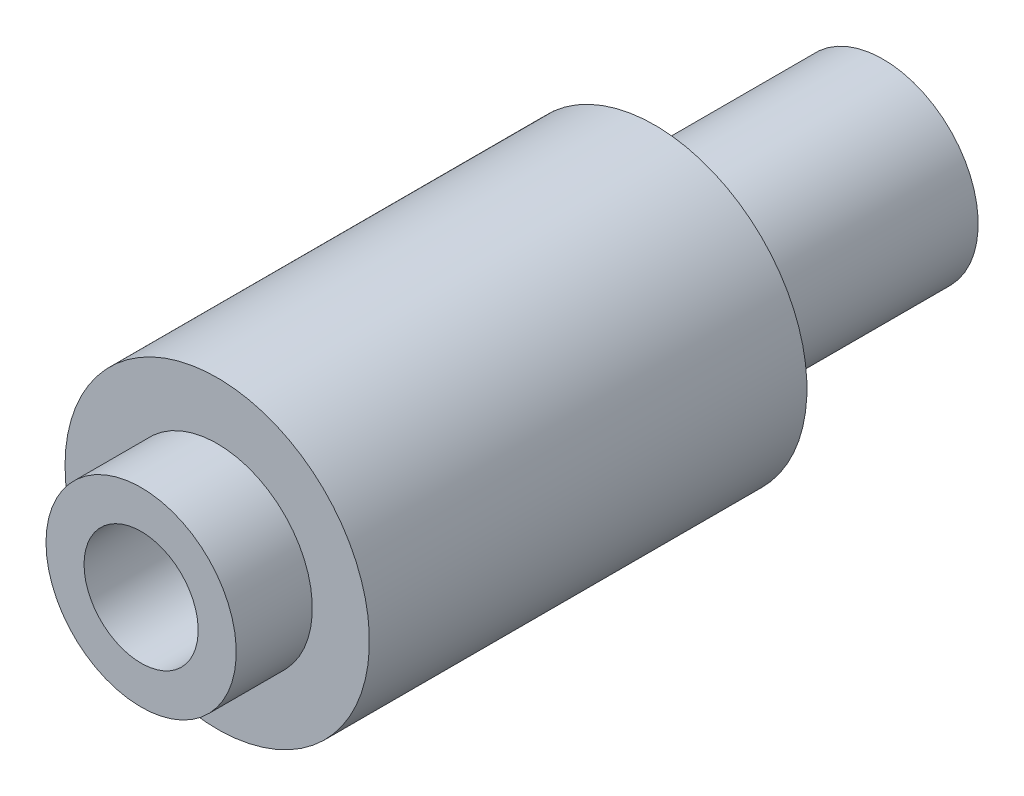
ISO-10303-21;
HEADER;
FILE_DESCRIPTION(('STEP AP214'),'2;1');
FILE_NAME('part.step','',(''),(''),'','','');
FILE_SCHEMA(('AUTOMOTIVE_DESIGN { 1 0 10303 214 1 1 1 1 }'));
ENDSEC;
DATA;
#1=APPLICATION_CONTEXT('core data for automotive mechanical design processes');
#2=APPLICATION_PROTOCOL_DEFINITION('international standard','automotive_design',2000,#1);
#3=PRODUCT_CONTEXT('',#1,'mechanical');
#4=PRODUCT('Part','Part','',(#3));
#5=PRODUCT_RELATED_PRODUCT_CATEGORY('part','',(#4));
#6=PRODUCT_DEFINITION_FORMATION('','',#4);
#7=PRODUCT_DEFINITION_CONTEXT('part definition',#1,'design');
#8=PRODUCT_DEFINITION('design','',#6,#7);
#9=PRODUCT_DEFINITION_SHAPE('','',#8);
#10=(LENGTH_UNIT() NAMED_UNIT(*) SI_UNIT(.MILLI.,.METRE.));
#11=(NAMED_UNIT(*) PLANE_ANGLE_UNIT() SI_UNIT($,.RADIAN.));
#12=(NAMED_UNIT(*) SI_UNIT($,.STERADIAN.) SOLID_ANGLE_UNIT());
#13=UNCERTAINTY_MEASURE_WITH_UNIT(LENGTH_MEASURE(1.E-05),#10,'distance_accuracy_value','');
#14=(GEOMETRIC_REPRESENTATION_CONTEXT(3) GLOBAL_UNCERTAINTY_ASSIGNED_CONTEXT((#13)) GLOBAL_UNIT_ASSIGNED_CONTEXT((#10,
#11,#12)) REPRESENTATION_CONTEXT('',''));
#15=CARTESIAN_POINT('',(0.,0.,0.));
#16=DIRECTION('',(0.,0.,1.));
#17=DIRECTION('',(1.,0.,0.));
#18=AXIS2_PLACEMENT_3D('',#15,#16,#17);
#19=CARTESIAN_POINT('',(0.,0.,-9.75));
#20=DIRECTION('',(0.,0.,1.));
#21=DIRECTION('',(1.,0.,0.));
#22=AXIS2_PLACEMENT_3D('',#19,#20,#21);
#23=PLANE('',#22);
#24=CARTESIAN_POINT('',(0.,0.,-9.75));
#25=DIRECTION('',(0.,0.,-1.));
#26=DIRECTION('',(-1.,0.,0.));
#27=AXIS2_PLACEMENT_3D('',#24,#25,#26);
#28=CIRCLE('',#27,2.5);
#29=CARTESIAN_POINT('',(-2.5,0.,-9.75));
#30=VERTEX_POINT('',#29);
#31=EDGE_CURVE('E10',#30,#30,#28,.T.);
#32=ORIENTED_EDGE('',*,*,#31,.T.);
#33=EDGE_LOOP('',(#32));
#34=FACE_BOUND('',#33,.T.);
#35=CARTESIAN_POINT('',(0.,0.,-9.75));
#36=DIRECTION('',(0.,0.,1.));
#37=DIRECTION('',(1.,0.,0.));
#38=AXIS2_PLACEMENT_3D('',#35,#36,#37);
#39=CIRCLE('',#38,1.5);
#40=CARTESIAN_POINT('',(1.5,0.,-9.75));
#41=VERTEX_POINT('',#40);
#42=EDGE_CURVE('E57',#41,#41,#39,.F.);
#43=ORIENTED_EDGE('',*,*,#42,.F.);
#44=EDGE_LOOP('',(#43));
#45=FACE_BOUND('',#44,.T.);
#46=ADVANCED_FACE('F32',(#34,#45),#23,.F.);
#47=CARTESIAN_POINT('',(0.,0.,-28.5326086956522));
#48=DIRECTION('',(0.,0.,-1.));
#49=DIRECTION('',(-1.,0.,0.));
#50=AXIS2_PLACEMENT_3D('',#47,#48,#49);
#51=CYLINDRICAL_SURFACE('',#50,2.5);
#52=ORIENTED_EDGE('',*,*,#31,.F.);
#53=EDGE_LOOP('',(#52));
#54=FACE_BOUND('',#53,.T.);
#55=CARTESIAN_POINT('',(0.,0.,-3.75));
#56=DIRECTION('',(0.,0.,-1.));
#57=DIRECTION('',(-1.,0.,0.));
#58=AXIS2_PLACEMENT_3D('',#55,#56,#57);
#59=CIRCLE('',#58,2.5);
#60=CARTESIAN_POINT('',(-2.5,0.,-3.75));
#61=VERTEX_POINT('',#60);
#62=EDGE_CURVE('E38',#61,#61,#59,.T.);
#63=ORIENTED_EDGE('',*,*,#62,.T.);
#64=EDGE_LOOP('',(#63));
#65=FACE_BOUND('',#64,.T.);
#66=ADVANCED_FACE('F94',(#54,#65),#51,.T.);
#67=CARTESIAN_POINT('',(2.5,0.,-3.75));
#68=DIRECTION('',(0.,0.,1.));
#69=DIRECTION('',(1.,0.,0.));
#70=AXIS2_PLACEMENT_3D('',#67,#68,#69);
#71=PLANE('',#70);
#72=ORIENTED_EDGE('',*,*,#62,.F.);
#73=EDGE_LOOP('',(#72));
#74=FACE_BOUND('',#73,.T.);
#75=CARTESIAN_POINT('',(0.,0.,-3.75));
#76=DIRECTION('',(0.,0.,-1.));
#77=DIRECTION('',(-1.,0.,0.));
#78=AXIS2_PLACEMENT_3D('',#75,#76,#77);
#79=CIRCLE('',#78,4.);
#80=CARTESIAN_POINT('',(-4.,0.,-3.75));
#81=VERTEX_POINT('',#80);
#82=EDGE_CURVE('E42',#81,#81,#79,.T.);
#83=ORIENTED_EDGE('',*,*,#82,.T.);
#84=EDGE_LOOP('',(#83));
#85=FACE_BOUND('',#84,.T.);
#86=ADVANCED_FACE('F98',(#74,#85),#71,.F.);
#87=CARTESIAN_POINT('',(0.,0.,-28.5326086956522));
#88=DIRECTION('',(0.,0.,-1.));
#89=DIRECTION('',(-1.,0.,0.));
#90=AXIS2_PLACEMENT_3D('',#87,#88,#89);
#91=CYLINDRICAL_SURFACE('',#90,4.);
#92=ORIENTED_EDGE('',*,*,#82,.F.);
#93=EDGE_LOOP('',(#92));
#94=FACE_BOUND('',#93,.T.);
#95=CARTESIAN_POINT('',(0.,0.,7.75));
#96=DIRECTION('',(0.,0.,-1.));
#97=DIRECTION('',(-1.,0.,0.));
#98=AXIS2_PLACEMENT_3D('',#95,#96,#97);
#99=CIRCLE('',#98,4.);
#100=CARTESIAN_POINT('',(-4.,0.,7.75));
#101=VERTEX_POINT('',#100);
#102=EDGE_CURVE('E46',#101,#101,#99,.T.);
#103=ORIENTED_EDGE('',*,*,#102,.T.);
#104=EDGE_LOOP('',(#103));
#105=FACE_BOUND('',#104,.T.);
#106=ADVANCED_FACE('F105',(#94,#105),#91,.T.);
#107=CARTESIAN_POINT('',(4.,0.,7.75));
#108=DIRECTION('',(0.,0.,-1.));
#109=DIRECTION('',(-1.,0.,0.));
#110=AXIS2_PLACEMENT_3D('',#107,#108,#109);
#111=PLANE('',#110);
#112=ORIENTED_EDGE('',*,*,#102,.F.);
#113=EDGE_LOOP('',(#112));
#114=FACE_BOUND('',#113,.T.);
#115=CARTESIAN_POINT('',(0.,0.,7.75));
#116=DIRECTION('',(0.,0.,-1.));
#117=DIRECTION('',(-1.,0.,0.));
#118=AXIS2_PLACEMENT_3D('',#115,#116,#117);
#119=CIRCLE('',#118,2.5);
#120=CARTESIAN_POINT('',(-2.5,0.,7.75));
#121=VERTEX_POINT('',#120);
#122=EDGE_CURVE('E51',#121,#121,#119,.T.);
#123=ORIENTED_EDGE('',*,*,#122,.T.);
#124=EDGE_LOOP('',(#123));
#125=FACE_BOUND('',#124,.T.);
#126=ADVANCED_FACE('F111',(#114,#125),#111,.F.);
#127=CARTESIAN_POINT('',(0.,0.,-28.5326086956522));
#128=DIRECTION('',(0.,0.,-1.));
#129=DIRECTION('',(-1.,0.,0.));
#130=AXIS2_PLACEMENT_3D('',#127,#128,#129);
#131=CYLINDRICAL_SURFACE('',#130,2.5);
#132=ORIENTED_EDGE('',*,*,#122,.F.);
#133=EDGE_LOOP('',(#132));
#134=FACE_BOUND('',#133,.T.);
#135=CARTESIAN_POINT('',(0.,0.,9.75));
#136=DIRECTION('',(0.,0.,-1.));
#137=DIRECTION('',(-1.,0.,0.));
#138=AXIS2_PLACEMENT_3D('',#135,#136,#137);
#139=CIRCLE('',#138,2.5);
#140=CARTESIAN_POINT('',(-2.5,0.,9.75));
#141=VERTEX_POINT('',#140);
#142=EDGE_CURVE('E54',#141,#141,#139,.T.);
#143=ORIENTED_EDGE('',*,*,#142,.T.);
#144=EDGE_LOOP('',(#143));
#145=FACE_BOUND('',#144,.T.);
#146=ADVANCED_FACE('F90',(#134,#145),#131,.T.);
#147=CARTESIAN_POINT('',(2.5,0.,9.75));
#148=DIRECTION('',(0.,0.,-1.));
#149=DIRECTION('',(-1.,0.,0.));
#150=AXIS2_PLACEMENT_3D('',#147,#148,#149);
#151=PLANE('',#150);
#152=CARTESIAN_POINT('',(0.,0.,9.75));
#153=DIRECTION('',(0.,0.,-1.));
#154=DIRECTION('',(-1.,0.,0.));
#155=AXIS2_PLACEMENT_3D('',#152,#153,#154);
#156=CIRCLE('',#155,1.5);
#157=CARTESIAN_POINT('',(-1.5,0.,9.75));
#158=VERTEX_POINT('',#157);
#159=EDGE_CURVE('E58',#158,#158,#156,.T.);
#160=ORIENTED_EDGE('',*,*,#159,.T.);
#161=EDGE_LOOP('',(#160));
#162=FACE_BOUND('',#161,.T.);
#163=ORIENTED_EDGE('',*,*,#142,.F.);
#164=EDGE_LOOP('',(#163));
#165=FACE_BOUND('',#164,.T.);
#166=ADVANCED_FACE('F81',(#162,#165),#151,.F.);
#167=CARTESIAN_POINT('',(0.,0.,-28.5326086956522));
#168=DIRECTION('',(0.,0.,-1.));
#169=DIRECTION('',(-1.,0.,0.));
#170=AXIS2_PLACEMENT_3D('',#167,#168,#169);
#171=CYLINDRICAL_SURFACE('',#170,1.5);
#172=ORIENTED_EDGE('',*,*,#42,.T.);
#173=EDGE_LOOP('',(#172));
#174=FACE_BOUND('',#173,.T.);
#175=CARTESIAN_POINT('',(0.,0.,-2.75));
#176=DIRECTION('',(0.,0.,1.));
#177=DIRECTION('',(1.,0.,0.));
#178=AXIS2_PLACEMENT_3D('',#175,#176,#177);
#179=CIRCLE('',#178,1.5);
#180=CARTESIAN_POINT('',(1.5,0.,-2.75));
#181=VERTEX_POINT('',#180);
#182=EDGE_CURVE('E64',#181,#181,#179,.F.);
#183=ORIENTED_EDGE('',*,*,#182,.F.);
#184=EDGE_LOOP('',(#183));
#185=FACE_BOUND('',#184,.T.);
#186=ADVANCED_FACE('F79',(#174,#185),#171,.F.);
#187=CARTESIAN_POINT('',(2.5,0.,-2.75));
#188=DIRECTION('',(0.,0.,1.));
#189=DIRECTION('',(1.,0.,0.));
#190=AXIS2_PLACEMENT_3D('',#187,#188,#189);
#191=PLANE('',#190);
#192=ORIENTED_EDGE('',*,*,#182,.T.);
#193=EDGE_LOOP('',(#192));
#194=FACE_BOUND('',#193,.T.);
#195=CARTESIAN_POINT('',(0.,0.,-2.75));
#196=DIRECTION('',(0.,0.,1.));
#197=DIRECTION('',(1.,0.,0.));
#198=AXIS2_PLACEMENT_3D('',#195,#196,#197);
#199=CIRCLE('',#198,3.);
#200=CARTESIAN_POINT('',(3.,0.,-2.75));
#201=VERTEX_POINT('',#200);
#202=EDGE_CURVE('E70',#201,#201,#199,.F.);
#203=ORIENTED_EDGE('',*,*,#202,.F.);
#204=EDGE_LOOP('',(#203));
#205=FACE_BOUND('',#204,.T.);
#206=ADVANCED_FACE('F76',(#194,#205),#191,.T.);
#207=CARTESIAN_POINT('',(0.,0.,-28.5326086956522));
#208=DIRECTION('',(0.,0.,-1.));
#209=DIRECTION('',(-1.,0.,0.));
#210=AXIS2_PLACEMENT_3D('',#207,#208,#209);
#211=CYLINDRICAL_SURFACE('',#210,3.);
#212=ORIENTED_EDGE('',*,*,#202,.T.);
#213=EDGE_LOOP('',(#212));
#214=FACE_BOUND('',#213,.T.);
#215=CARTESIAN_POINT('',(0.,0.,6.75));
#216=DIRECTION('',(0.,0.,-1.));
#217=DIRECTION('',(-1.,0.,0.));
#218=AXIS2_PLACEMENT_3D('',#215,#216,#217);
#219=CIRCLE('',#218,3.);
#220=CARTESIAN_POINT('',(-3.,0.,6.75));
#221=VERTEX_POINT('',#220);
#222=EDGE_CURVE('E67',#221,#221,#219,.T.);
#223=ORIENTED_EDGE('',*,*,#222,.F.);
#224=EDGE_LOOP('',(#223));
#225=FACE_BOUND('',#224,.T.);
#226=ADVANCED_FACE('F88',(#214,#225),#211,.F.);
#227=CARTESIAN_POINT('',(4.,0.,6.75));
#228=DIRECTION('',(0.,0.,-1.));
#229=DIRECTION('',(-1.,0.,0.));
#230=AXIS2_PLACEMENT_3D('',#227,#228,#229);
#231=PLANE('',#230);
#232=ORIENTED_EDGE('',*,*,#222,.T.);
#233=EDGE_LOOP('',(#232));
#234=FACE_BOUND('',#233,.T.);
#235=CARTESIAN_POINT('',(0.,0.,6.75));
#236=DIRECTION('',(0.,0.,-1.));
#237=DIRECTION('',(-1.,0.,0.));
#238=AXIS2_PLACEMENT_3D('',#235,#236,#237);
#239=CIRCLE('',#238,1.5);
#240=CARTESIAN_POINT('',(-1.5,0.,6.75));
#241=VERTEX_POINT('',#240);
#242=EDGE_CURVE('E61',#241,#241,#239,.T.);
#243=ORIENTED_EDGE('',*,*,#242,.F.);
#244=EDGE_LOOP('',(#243));
#245=FACE_BOUND('',#244,.T.);
#246=ADVANCED_FACE('F122',(#234,#245),#231,.T.);
#247=CARTESIAN_POINT('',(0.,0.,-28.5326086956522));
#248=DIRECTION('',(0.,0.,-1.));
#249=DIRECTION('',(-1.,0.,0.));
#250=AXIS2_PLACEMENT_3D('',#247,#248,#249);
#251=CYLINDRICAL_SURFACE('',#250,1.5);
#252=ORIENTED_EDGE('',*,*,#242,.T.);
#253=EDGE_LOOP('',(#252));
#254=FACE_BOUND('',#253,.T.);
#255=ORIENTED_EDGE('',*,*,#159,.F.);
#256=EDGE_LOOP('',(#255));
#257=FACE_BOUND('',#256,.T.);
#258=ADVANCED_FACE('F119',(#254,#257),#251,.F.);
#259=CLOSED_SHELL('',(#46,#66,#86,#106,#126,#146,#166,#186,#206,#226,#246,#258));
#260=MANIFOLD_SOLID_BREP('B2',#259);
#261=ADVANCED_BREP_SHAPE_REPRESENTATION('',(#18,#260),#14);
#262=SHAPE_DEFINITION_REPRESENTATION(#9,#261);
ENDSEC;
END-ISO-10303-21;
